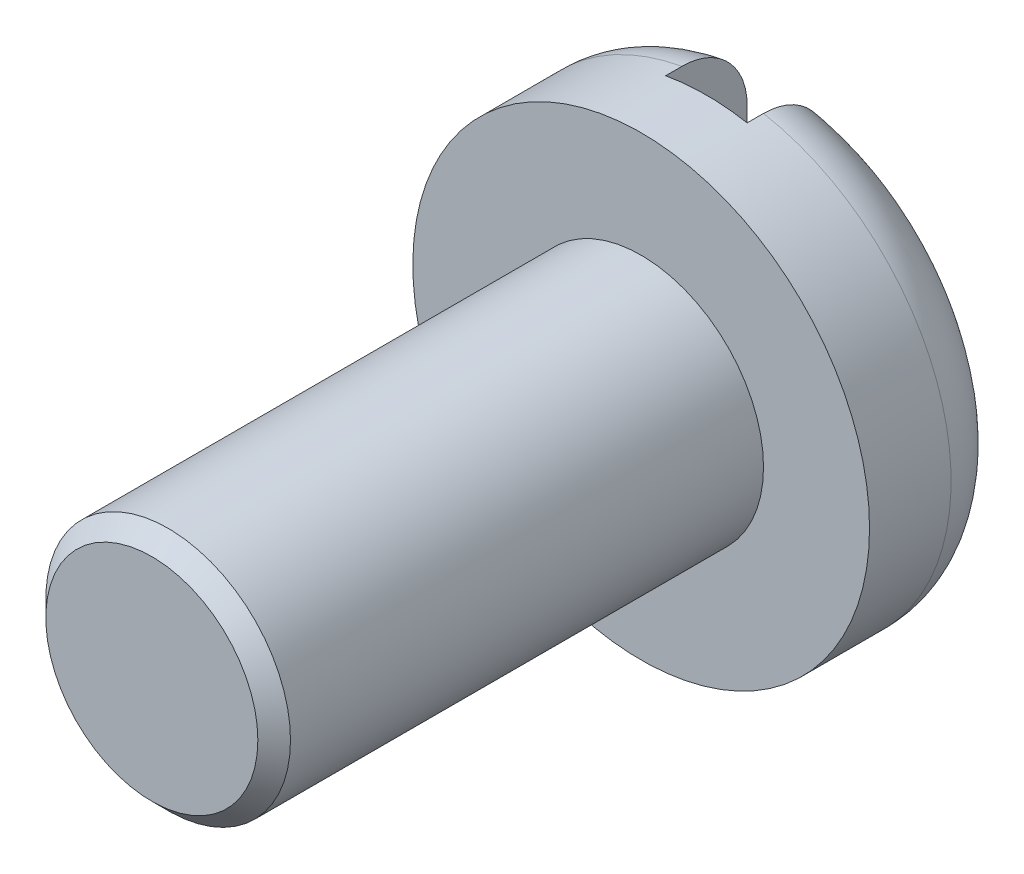
ISO-10303-21;
HEADER;
FILE_DESCRIPTION(('STEP AP214'),'2;1');
FILE_NAME('part.step','',(''),(''),'','','');
FILE_SCHEMA(('AUTOMOTIVE_DESIGN { 1 0 10303 214 1 1 1 1 }'));
ENDSEC;
DATA;
#1=APPLICATION_CONTEXT('core data for automotive mechanical design processes');
#2=APPLICATION_PROTOCOL_DEFINITION('international standard','automotive_design',2000,#1);
#3=PRODUCT_CONTEXT('',#1,'mechanical');
#4=PRODUCT('Part','Part','',(#3));
#5=PRODUCT_RELATED_PRODUCT_CATEGORY('part','',(#4));
#6=PRODUCT_DEFINITION_FORMATION('','',#4);
#7=PRODUCT_DEFINITION_CONTEXT('part definition',#1,'design');
#8=PRODUCT_DEFINITION('design','',#6,#7);
#9=PRODUCT_DEFINITION_SHAPE('','',#8);
#10=(LENGTH_UNIT() NAMED_UNIT(*) SI_UNIT(.MILLI.,.METRE.));
#11=(NAMED_UNIT(*) PLANE_ANGLE_UNIT() SI_UNIT($,.RADIAN.));
#12=(NAMED_UNIT(*) SI_UNIT($,.STERADIAN.) SOLID_ANGLE_UNIT());
#13=UNCERTAINTY_MEASURE_WITH_UNIT(LENGTH_MEASURE(1.E-05),#10,'distance_accuracy_value','');
#14=(GEOMETRIC_REPRESENTATION_CONTEXT(3) GLOBAL_UNCERTAINTY_ASSIGNED_CONTEXT((#13)) GLOBAL_UNIT_ASSIGNED_CONTEXT((#10,
#11,#12)) REPRESENTATION_CONTEXT('',''));
#15=CARTESIAN_POINT('',(0.,0.,0.));
#16=DIRECTION('',(0.,0.,1.));
#17=DIRECTION('',(1.,0.,0.));
#18=AXIS2_PLACEMENT_3D('',#15,#16,#17);
#19=CARTESIAN_POINT('',(0.,0.,0.));
#20=DIRECTION('',(0.,0.,1.));
#21=DIRECTION('',(1.,0.,0.));
#22=AXIS2_PLACEMENT_3D('',#19,#20,#21);
#23=PLANE('',#22);
#24=CARTESIAN_POINT('',(0.,0.,0.));
#25=DIRECTION('',(0.,0.,1.));
#26=DIRECTION('',(1.,0.,0.));
#27=AXIS2_PLACEMENT_3D('',#24,#25,#26);
#28=CIRCLE('',#27,2.);
#29=CARTESIAN_POINT('',(-0.5,-1.93649167310372,0.));
#30=VERTEX_POINT('',#29);
#31=CARTESIAN_POINT('',(-0.5,1.93649167310367,0.));
#32=VERTEX_POINT('',#31);
#33=EDGE_CURVE('E108',#30,#32,#28,.F.);
#34=ORIENTED_EDGE('',*,*,#33,.T.);
#35=DIRECTION('',(0.,1.,0.));
#36=VECTOR('',#35,1.);
#37=CARTESIAN_POINT('',(-0.499999999999987,-2.79999999999997,0.));
#38=LINE('',#37,#36);
#39=EDGE_CURVE('E96',#30,#32,#38,.T.);
#40=ORIENTED_EDGE('',*,*,#39,.F.);
#41=EDGE_LOOP('',(#34,#40));
#42=FACE_BOUND('',#41,.T.);
#43=ADVANCED_FACE('F34',(#42),#23,.F.);
#44=CARTESIAN_POINT('',(0.,0.,0.8));
#45=DIRECTION('',(0.,0.,1.));
#46=DIRECTION('',(1.,0.,0.));
#47=AXIS2_PLACEMENT_3D('',#44,#45,#46);
#48=TOROIDAL_SURFACE('',#47,2.,0.8);
#49=CARTESIAN_POINT('',(-0.500000000000042,-2.574922324518,0.298155199525206));
#50=CARTESIAN_POINT('',(-0.500000000000064,-2.54598098806483,0.262888244626921));
#51=CARTESIAN_POINT('',(-0.500000000000017,-2.51399085375587,0.230073383773666));
#52=CARTESIAN_POINT('',(-0.499999999999956,-2.44489770330804,0.170290375937446));
#53=CARTESIAN_POINT('',(-0.499999999999943,-2.40778734484533,0.14333077083532));
#54=CARTESIAN_POINT('',(-0.499999999999947,-2.3296378729819,0.0960285229568036));
#55=CARTESIAN_POINT('',(-0.499999999999966,-2.28860446041037,0.0756764619958677));
#56=CARTESIAN_POINT('',(-0.500000000000008,-2.20376135068432,0.0420244924251314));
#57=CARTESIAN_POINT('',(-0.500000000000031,-2.15995236699676,0.0287227796749258));
#58=CARTESIAN_POINT('',(-0.500000000000025,-2.06997091394333,0.00925183248130342));
#59=CARTESIAN_POINT('',(-0.499999999999993,-2.02377040690542,0.00321234810147741));
#60=CARTESIAN_POINT('',(-0.49999999999998,-1.93100263497437,-0.00124877563349874));
#61=CARTESIAN_POINT('',(-0.499999999999998,-1.88443530458141,0.000330977762108387));
#62=CARTESIAN_POINT('',(-0.500000000000003,-1.79088327346646,0.0111178799923772));
#63=CARTESIAN_POINT('',(-0.49999999999999,-1.7439228144173,0.0205353470541913));
#64=CARTESIAN_POINT('',(-0.499999999999983,-1.65217679369091,0.046935421935074));
#65=CARTESIAN_POINT('',(-0.499999999999988,-1.60739158710236,0.0639192603179388));
#66=CARTESIAN_POINT('',(-0.499999999999985,-1.52019073232421,0.105445949791884));
#67=CARTESIAN_POINT('',(-0.499999999999978,-1.47785400136175,0.130154782287374));
#68=CARTESIAN_POINT('',(-0.499999999999995,-1.39792453015221,0.18634538845088));
#69=CARTESIAN_POINT('',(-0.50000000000002,-1.36033263198163,0.217828361667366));
#70=CARTESIAN_POINT('',(-0.500000000000009,-1.29120447950117,0.286694192458513));
#71=CARTESIAN_POINT('',(-0.499999999999974,-1.25965123178523,0.324059937841605));
#72=CARTESIAN_POINT('',(-0.499999999999999,-1.20369168856285,0.403817480274002));
#73=CARTESIAN_POINT('',(-0.500000000000059,-1.17928268604714,0.44620736506247));
#74=CARTESIAN_POINT('',(-0.500000000000053,-1.13992248130589,0.532354713105318));
#75=CARTESIAN_POINT('',(-0.499999999999993,-1.12452210271751,0.575906194985524));
#76=CARTESIAN_POINT('',(-0.49999999999998,-1.10201829416784,0.66509381867765));
#77=CARTESIAN_POINT('',(-0.500000000000027,-1.09490840158941,0.710728307862662));
#78=CARTESIAN_POINT('',(-0.500000000000029,-1.08965339575104,0.798660775802905));
#79=CARTESIAN_POINT('',(-0.499999999999991,-1.09080730068015,0.840918076012923));
#80=CARTESIAN_POINT('',(-0.499999999999982,-1.10037450172082,0.924598224718412));
#81=CARTESIAN_POINT('',(-0.500000000000013,-1.10878745994187,0.966021111961848));
#82=CARTESIAN_POINT('',(-0.500000000000016,-1.13216837267961,1.04597158865165));
#83=CARTESIAN_POINT('',(-0.499999999999991,-1.14698904456269,1.08454267031556));
#84=CARTESIAN_POINT('',(-0.499999999999982,-1.18251177579709,1.15886756045566));
#85=CARTESIAN_POINT('',(-0.5,-1.20321527714693,1.19462067544403));
#86=CARTESIAN_POINT('',(-0.500000000000001,-1.25126751354911,1.26474992143909));
#87=CARTESIAN_POINT('',(-0.499999999999984,-1.27895554890733,1.29889325268955));
#88=CARTESIAN_POINT('',(-0.499999999999989,-1.3392878702617,1.36247528595323));
#89=CARTESIAN_POINT('',(-0.500000000000013,-1.37193384773364,1.39191237529941));
#90=CARTESIAN_POINT('',(-0.500000000000016,-1.44401810740901,1.44758530807222));
#91=CARTESIAN_POINT('',(-0.49999999999999,-1.48378730323865,1.47339358366004));
#92=CARTESIAN_POINT('',(-0.499999999999983,-1.56697728558621,1.51824355540426));
#93=CARTESIAN_POINT('',(-0.5,-1.61039886330884,1.53728378072535));
#94=CARTESIAN_POINT('',(-0.500000000000001,-1.70136104276629,1.56863849264839));
#95=CARTESIAN_POINT('',(-0.499999999999984,-1.74899346897788,1.58068768090996));
#96=CARTESIAN_POINT('',(-0.499999999999989,-1.84561382312309,1.59655662210236));
#97=CARTESIAN_POINT('',(-0.500000000000011,-1.89460174641329,1.60037640322053));
#98=CARTESIAN_POINT('',(-0.500000000000017,-1.9921524314953,1.59956806537918));
#99=CARTESIAN_POINT('',(-0.500000000000002,-2.04071566638595,1.59500198496043));
#100=CARTESIAN_POINT('',(-0.499999999999971,-2.13632725414342,1.57755309739998));
#101=CARTESIAN_POINT('',(-0.499999999999956,-2.18337580544831,1.56467138437918));
#102=CARTESIAN_POINT('',(-0.499999999999962,-2.27328529537051,1.53131446404627));
#103=CARTESIAN_POINT('',(-0.499999999999981,-2.3162240941652,1.51104918059278));
#104=CARTESIAN_POINT('',(-0.499999999999992,-2.39795495079203,1.46340202209778));
#105=CARTESIAN_POINT('',(-0.499999999999983,-2.43674763214091,1.43602121925978));
#106=CARTESIAN_POINT('',(-0.499999999999963,-2.50796623414367,1.37573601278644));
#107=CARTESIAN_POINT('',(-0.499999999999952,-2.54053689486565,1.34300254475207));
#108=CARTESIAN_POINT('',(-0.500000000000021,-2.59957752568887,1.2724306558834));
#109=CARTESIAN_POINT('',(-0.500000000000102,-2.62604823039698,1.23459285062639));
#110=CARTESIAN_POINT('',(-0.500000000000093,-2.67157353959601,1.15573976382321));
#111=CARTESIAN_POINT('',(-0.500000000000008,-2.69077061117966,1.11480669165031));
#112=CARTESIAN_POINT('',(-0.499999999999965,-2.72191897598462,1.03027270766606));
#113=CARTESIAN_POINT('',(-0.500000000000008,-2.73387115561365,0.986672122942012));
#114=CARTESIAN_POINT('',(-0.500000000000021,-2.75005556797333,0.898637160107996));
#115=CARTESIAN_POINT('',(-0.499999999999992,-2.75438419022644,0.854220475286738));
#116=CARTESIAN_POINT('',(-0.499999999999981,-2.75548594113135,0.765281171564029));
#117=CARTESIAN_POINT('',(-0.5,-2.75225733036693,0.720758530631277));
#118=CARTESIAN_POINT('',(-0.500000000000001,-2.73837145135229,0.633077517478008));
#119=CARTESIAN_POINT('',(-0.499999999999984,-2.72774415965583,0.589914372145898));
#120=CARTESIAN_POINT('',(-0.499999999999989,-2.69941974932609,0.506017569457456));
#121=CARTESIAN_POINT('',(-0.500000000000011,-2.68173177147183,0.465280848903881));
#122=CARTESIAN_POINT('',(-0.499999999999995,-2.6486018933594,0.403636926764014));
#123=CARTESIAN_POINT('',(-0.499999999999978,-2.63530419806188,0.381550226470756));
#124=CARTESIAN_POINT('',(-0.499999999999995,-2.60663582244822,0.338766791147228));
#125=CARTESIAN_POINT('',(-0.50000000000003,-2.59126516322905,0.318070041974346));
#126=CARTESIAN_POINT('',(-0.500000000000042,-2.574922324518,0.298155199525206));
#127=B_SPLINE_CURVE_WITH_KNOTS('',3,(#49,#50,#51,#52,#53,#54,#55,#56,#57,#58,#59,#60,#61,#62,
#63,#64,#65,#66,#67,#68,#69,#70,#71,#72,#73,#74,#75,#76,#77,#78,#79,#80,#81,#82,#83,#84,#85,#86,
#87,#88,#89,#90,#91,#92,#93,#94,#95,#96,#97,#98,#99,#100,#101,#102,#103,#104,#105,#106,#107,
#108,#109,#110,#111,#112,#113,#114,#115,#116,#117,#118,#119,#120,#121,#122,#123,#124,#125,#126),
.UNSPECIFIED.,.T.,.F.,(4,2,2,2,2,2,2,2,2,2,2,2,2,2,2,2,2,2,2,2,2,2,2,2,2,2,2,2,2,2,2,2,2,2,2,2,
2,2,4),(0.,0.136769193085177,0.273736589920394,0.410507891781044,0.547244177795591,
0.68638878734272,0.825558832649965,0.968588530443755,1.11164149850147,1.25800809201401,
1.40440062513062,1.5503749329885,1.69629385824464,1.83412607973232,1.97185078597633,
2.0980401485379,2.22422363762208,2.34764929877682,2.47110524015382,2.60242555016918,
2.73379076312852,2.87538180880564,3.01700360631827,3.16369746316592,3.3103908175575,
3.45600330421428,3.60159663596026,3.74333790058163,3.88505781926302,4.02291414270548,
4.16075385566943,4.29573382427652,4.43069727483905,4.56394170366886,4.69721680381809,
4.82995504436945,4.96252199615689,5.0397547671254,5.11698675213922),.UNSPECIFIED.);
#128=CARTESIAN_POINT('',(-0.499999999999917,-2.75499546279123,0.8));
#129=VERTEX_POINT('',#128);
#130=EDGE_CURVE('E152',#129,#30,#127,.T.);
#131=ORIENTED_EDGE('',*,*,#130,.F.);
#132=CARTESIAN_POINT('',(0.,0.,0.8));
#133=DIRECTION('',(0.,0.,1.));
#134=DIRECTION('',(1.,0.,0.));
#135=AXIS2_PLACEMENT_3D('',#132,#133,#134);
#136=CIRCLE('',#135,2.8);
#137=CARTESIAN_POINT('',(-0.500000000000028,2.7549954627912,0.8));
#138=VERTEX_POINT('',#137);
#139=EDGE_CURVE('E109',#138,#129,#136,.T.);
#140=ORIENTED_EDGE('',*,*,#139,.F.);
#141=CARTESIAN_POINT('',(-0.499999999356501,1.17166829458473,0.46418686904753));
#142=CARTESIAN_POINT('',(-0.499999999007219,1.19267357615146,0.422417780507498));
#143=CARTESIAN_POINT('',(-0.499999999733716,1.21743797333864,0.382484068214903));
#144=CARTESIAN_POINT('',(-0.500000000266866,1.27341877739793,0.30735400104595));
#145=CARTESIAN_POINT('',(-0.500000000071411,1.30464980628043,0.272168686107269));
#146=CARTESIAN_POINT('',(-0.499999999928815,1.37235748491803,0.207510707786025));
#147=CARTESIAN_POINT('',(-0.499999999980891,1.40881724534706,0.178020342456158));
#148=CARTESIAN_POINT('',(-0.500000000019074,1.48597833534383,0.125299278185819));
#149=CARTESIAN_POINT('',(-0.500000000005209,1.5266777935571,0.10206583361082));
#150=CARTESIAN_POINT('',(-0.499999999994576,1.61302287504707,0.0615752064472882));
#151=CARTESIAN_POINT('',(-0.49999999999854,1.65880348194959,0.0446051102007901));
#152=CARTESIAN_POINT('',(-0.500000000001434,1.75256520926182,0.0185470420039302));
#153=CARTESIAN_POINT('',(-0.500000000000363,1.80054669322732,0.00946037726494076));
#154=CARTESIAN_POINT('',(-0.499999999999581,1.89757398197848,-0.000503602469736283));
#155=CARTESIAN_POINT('',(-0.499999999999874,1.94662352533386,-0.00134482041100667));
#156=CARTESIAN_POINT('',(-0.500000000000099,2.04413927232538,0.00542159003976711));
#157=CARTESIAN_POINT('',(-0.50000000000003,2.09260554052552,0.0130282744560471));
#158=CARTESIAN_POINT('',(-0.499999999999972,2.18638284766427,0.0363136597219342));
#159=CARTESIAN_POINT('',(-0.499999999999981,2.23174072313643,0.0518035405617408));
#160=CARTESIAN_POINT('',(-0.499999999999993,2.31909462384134,0.090397317595015));
#161=CARTESIAN_POINT('',(-0.499999999999995,2.36109117492435,0.113500019923071));
#162=CARTESIAN_POINT('',(-0.500000000000005,2.43926883717495,0.165951907511055));
#163=CARTESIAN_POINT('',(-0.500000000000012,2.47558066725009,0.195106304948042));
#164=CARTESIAN_POINT('',(-0.499999999999961,2.54264688321358,0.259229250250845));
#165=CARTESIAN_POINT('',(-0.499999999999904,2.57340200694014,0.294197025011071));
#166=CARTESIAN_POINT('',(-0.499999999999903,2.62773971054273,0.368070214995808));
#167=CARTESIAN_POINT('',(-0.499999999999957,2.65147213285657,0.406865462624137));
#168=CARTESIAN_POINT('',(-0.500000000000016,2.69196936040413,0.487936656036954));
#169=CARTESIAN_POINT('',(-0.500000000000021,2.70873482403591,0.530212272463766));
#170=CARTESIAN_POINT('',(-0.500000000000007,2.73457417408301,0.616346516557325));
#171=CARTESIAN_POINT('',(-0.499999999999988,2.74376162387099,0.660171105210678));
#172=CARTESIAN_POINT('',(-0.499999999999985,2.75459021275317,0.748742353799453));
#173=CARTESIAN_POINT('',(-0.5,2.7562317357709,0.793488966707539));
#174=CARTESIAN_POINT('',(-0.500000000000001,2.75193406507526,0.882296051446308));
#175=CARTESIAN_POINT('',(-0.499999999999988,2.7460486796649,0.926359139654561));
#176=CARTESIAN_POINT('',(-0.499999999999985,2.72696875366774,1.01287203680982));
#177=CARTESIAN_POINT('',(-0.499999999999996,2.7137742978086,1.05532186445184));
#178=CARTESIAN_POINT('',(-0.500000000000004,2.68046062721738,1.13744918694941));
#179=CARTESIAN_POINT('',(-0.500000000000001,2.66033585198125,1.17712442478083));
#180=CARTESIAN_POINT('',(-0.499999999999972,2.61376491387087,1.25257058669212));
#181=CARTESIAN_POINT('',(-0.499999999999946,2.58731858541521,1.28834140846729));
#182=CARTESIAN_POINT('',(-0.499999999999944,2.5286285872319,1.35530700199108));
#183=CARTESIAN_POINT('',(-0.49999999999997,2.49633699794396,1.38645975622345));
#184=CARTESIAN_POINT('',(-0.500000000000003,2.42705565551312,1.44300481630574));
#185=CARTESIAN_POINT('',(-0.500000000000012,2.39006560545065,1.4683967578179));
#186=CARTESIAN_POINT('',(-0.499999999999989,2.31180075625716,1.51316085536133));
#187=CARTESIAN_POINT('',(-0.499999999999956,2.27046570719732,1.53242761609144));
#188=CARTESIAN_POINT('',(-0.500000000000017,2.18519964476282,1.5639258999662));
#189=CARTESIAN_POINT('',(-0.50000000000011,2.14126836546617,1.57615670106222));
#190=CARTESIAN_POINT('',(-0.500000000000113,2.0509556255416,1.59355624479341));
#191=CARTESIAN_POINT('',(-0.500000000000017,2.00454082128188,1.59855176700942));
#192=CARTESIAN_POINT('',(-0.499999999999956,1.91151980618021,1.60090411836747));
#193=CARTESIAN_POINT('',(-0.49999999999999,1.86491356935927,1.598259874062));
#194=CARTESIAN_POINT('',(-0.500000000000012,1.77145545960404,1.58532047051574));
#195=CARTESIAN_POINT('',(-0.499999999999998,1.72463270294184,1.57481489696403));
#196=CARTESIAN_POINT('',(-0.499999999999975,1.63334046852717,1.54626900741675));
#197=CARTESIAN_POINT('',(-0.499999999999965,1.58887138887822,1.52822742133131));
#198=CARTESIAN_POINT('',(-0.499999999999981,1.50252916218816,1.48463309532452));
#199=CARTESIAN_POINT('',(-0.500000000000006,1.46073564384593,1.45892237778647));
#200=CARTESIAN_POINT('',(-0.499999999999967,1.38206930059477,1.40081364332638));
#201=CARTESIAN_POINT('',(-0.499999999999901,1.34519732545493,1.36841447400829));
#202=CARTESIAN_POINT('',(-0.499999999999988,1.27778696417982,1.29792975959294));
#203=CARTESIAN_POINT('',(-0.500000000000139,1.24721327878641,1.25987808510847));
#204=CARTESIAN_POINT('',(-0.499999999999834,1.19335612750725,1.17891848718443));
#205=CARTESIAN_POINT('',(-0.499999999999378,1.17006907448704,1.13601296745241));
#206=CARTESIAN_POINT('',(-0.500000000000586,1.13308127721679,1.04923883676593));
#207=CARTESIAN_POINT('',(-0.500000000002125,1.11889370908597,1.00557843081165));
#208=CARTESIAN_POINT('',(-0.499999999997849,1.09880075562412,0.916385157633365));
#209=CARTESIAN_POINT('',(-0.499999999992037,1.09289167625854,0.870853134905996));
#210=CARTESIAN_POINT('',(-0.500000000007284,1.08985288930712,0.783258016819354));
#211=CARTESIAN_POINT('',(-0.500000000026179,1.09204273372152,0.741216766124547));
#212=CARTESIAN_POINT('',(-0.49999999997383,1.10358165617668,0.658171003192909));
#213=CARTESIAN_POINT('',(-0.49999999990271,1.11292095412185,0.617165153669265));
#214=CARTESIAN_POINT('',(-0.500000000047387,1.13173716442364,0.557832094241281));
#215=CARTESIAN_POINT('',(-0.500000000134682,1.13868424430638,0.538665049516267));
#216=CARTESIAN_POINT('',(-0.499999999865315,1.15407246676007,0.500944817183134));
#217=CARTESIAN_POINT('',(-0.499999999508732,1.16251334591183,0.482391522028879));
#218=CARTESIAN_POINT('',(-0.499999999356501,1.17166829458473,0.46418686904753));
#219=B_SPLINE_CURVE_WITH_KNOTS('',3,(#141,#142,#143,#144,#145,#146,#147,#148,#149,#150,#151,
#152,#153,#154,#155,#156,#157,#158,#159,#160,#161,#162,#163,#164,#165,#166,#167,#168,#169,#170,
#171,#172,#173,#174,#175,#176,#177,#178,#179,#180,#181,#182,#183,#184,#185,#186,#187,#188,#189,
#190,#191,#192,#193,#194,#195,#196,#197,#198,#199,#200,#201,#202,#203,#204,#205,#206,#207,#208,
#209,#210,#211,#212,#213,#214,#215,#216,#217,#218),.UNSPECIFIED.,.T.,.F.,(4,2,2,2,2,2,2,2,2,2,2,
2,2,2,2,2,2,2,2,2,2,2,2,2,2,2,2,2,2,2,2,2,2,2,2,2,2,2,4),(0.,0.140179962938361,
0.280680424374975,0.420736870704918,0.560731757564349,0.706519737259577,0.852331886544,
0.998782091076204,1.14521593278487,1.28829675581313,1.43135515114943,1.57037428224833,
1.70937494032989,1.84515095108353,1.98091412768567,2.11460378002058,2.24828663038504,
2.38101913030596,2.5137500916072,2.64658779796054,2.77942898413334,2.91341306192966,
3.04740561107584,3.18359253664264,3.31979343557669,3.45920410723755,3.59863436815094,
3.74193637650256,3.88526254616111,4.03177315461668,4.17830902741986,4.32399983406551,
4.46961880536737,4.60659735480203,4.74351476205878,4.86920017065931,4.99471395445012,
5.05582079954678,5.11691687967277),.UNSPECIFIED.);
#220=EDGE_CURVE('E105',#32,#138,#219,.T.);
#221=ORIENTED_EDGE('',*,*,#220,.F.);
#222=ORIENTED_EDGE('',*,*,#33,.F.);
#223=EDGE_LOOP('',(#131,#140,#221,#222));
#224=FACE_BOUND('',#223,.T.);
#225=ADVANCED_FACE('F169',(#224),#48,.T.);
#226=CARTESIAN_POINT('',(0.,0.,1.8));
#227=DIRECTION('',(0.,0.,1.));
#228=DIRECTION('',(1.,0.,0.));
#229=AXIS2_PLACEMENT_3D('',#226,#227,#228);
#230=PLANE('',#229);
#231=CARTESIAN_POINT('',(0.,0.,1.8));
#232=DIRECTION('',(0.,0.,1.));
#233=DIRECTION('',(1.,0.,0.));
#234=AXIS2_PLACEMENT_3D('',#231,#232,#233);
#235=CIRCLE('',#234,2.8);
#236=CARTESIAN_POINT('',(2.8,0.,1.8));
#237=VERTEX_POINT('',#236);
#238=EDGE_CURVE('E181',#237,#237,#235,.T.);
#239=ORIENTED_EDGE('',*,*,#238,.T.);
#240=EDGE_LOOP('',(#239));
#241=FACE_BOUND('',#240,.T.);
#242=CARTESIAN_POINT('',(0.,0.,1.8));
#243=DIRECTION('',(0.,0.,1.));
#244=DIRECTION('',(1.,0.,0.));
#245=AXIS2_PLACEMENT_3D('',#242,#243,#244);
#246=CIRCLE('',#245,1.5);
#247=CARTESIAN_POINT('',(1.5,0.,1.8));
#248=VERTEX_POINT('',#247);
#249=EDGE_CURVE('E179',#248,#248,#246,.T.);
#250=ORIENTED_EDGE('',*,*,#249,.F.);
#251=EDGE_LOOP('',(#250));
#252=FACE_BOUND('',#251,.T.);
#253=ADVANCED_FACE('F186',(#241,#252),#230,.T.);
#254=CARTESIAN_POINT('',(0.,0.,1.8));
#255=DIRECTION('',(0.,0.,-1.));
#256=DIRECTION('',(-1.,0.,0.));
#257=AXIS2_PLACEMENT_3D('',#254,#255,#256);
#258=CYLINDRICAL_SURFACE('',#257,2.8);
#259=CARTESIAN_POINT('',(0.499999999999987,-2.75499546279118,0.8));
#260=VERTEX_POINT('',#259);
#261=CARTESIAN_POINT('',(0.5,2.75499546279118,0.8));
#262=VERTEX_POINT('',#261);
#263=EDGE_CURVE('E104',#260,#262,#136,.T.);
#264=ORIENTED_EDGE('',*,*,#263,.T.);
#265=DIRECTION('',(0.,0.,-1.));
#266=VECTOR('',#265,1.);
#267=CARTESIAN_POINT('',(0.5,2.75499546279118,1.8));
#268=LINE('',#267,#266);
#269=CARTESIAN_POINT('',(0.5,2.75499546279118,1.));
#270=VERTEX_POINT('',#269);
#271=EDGE_CURVE('E49',#262,#270,#268,.F.);
#272=ORIENTED_EDGE('',*,*,#271,.T.);
#273=CARTESIAN_POINT('',(0.,0.,1.));
#274=DIRECTION('',(0.,0.,1.));
#275=DIRECTION('',(1.,0.,0.));
#276=AXIS2_PLACEMENT_3D('',#273,#274,#275);
#277=CIRCLE('',#276,2.8);
#278=CARTESIAN_POINT('',(-0.500000000000028,2.7549954627912,1.));
#279=VERTEX_POINT('',#278);
#280=EDGE_CURVE('E38',#270,#279,#277,.T.);
#281=ORIENTED_EDGE('',*,*,#280,.T.);
#282=DIRECTION('',(0.,0.,-1.));
#283=VECTOR('',#282,1.);
#284=CARTESIAN_POINT('',(-0.500000000000028,2.7549954627912,1.8));
#285=LINE('',#284,#283);
#286=EDGE_CURVE('E160',#279,#138,#285,.T.);
#287=ORIENTED_EDGE('',*,*,#286,.T.);
#288=ORIENTED_EDGE('',*,*,#139,.T.);
#289=DIRECTION('',(0.,0.,-1.));
#290=VECTOR('',#289,1.);
#291=CARTESIAN_POINT('',(-0.499999999999917,-2.75499546279123,1.8));
#292=LINE('',#291,#290);
#293=CARTESIAN_POINT('',(-0.499999999999917,-2.75499546279123,1.));
#294=VERTEX_POINT('',#293);
#295=EDGE_CURVE('E57',#129,#294,#292,.F.);
#296=ORIENTED_EDGE('',*,*,#295,.T.);
#297=CARTESIAN_POINT('',(0.499999999999987,-2.75499546279118,1.));
#298=VERTEX_POINT('',#297);
#299=EDGE_CURVE('E11',#294,#298,#277,.T.);
#300=ORIENTED_EDGE('',*,*,#299,.T.);
#301=DIRECTION('',(0.,0.,-1.));
#302=VECTOR('',#301,1.);
#303=CARTESIAN_POINT('',(0.499999999999987,-2.75499546279118,1.8));
#304=LINE('',#303,#302);
#305=EDGE_CURVE('E167',#298,#260,#304,.T.);
#306=ORIENTED_EDGE('',*,*,#305,.T.);
#307=EDGE_LOOP('',(#264,#272,#281,#287,#288,#296,#300,#306));
#308=FACE_BOUND('',#307,.T.);
#309=ORIENTED_EDGE('',*,*,#238,.F.);
#310=EDGE_LOOP('',(#309));
#311=FACE_BOUND('',#310,.T.);
#312=ADVANCED_FACE('F36',(#308,#311),#258,.T.);
#313=CARTESIAN_POINT('',(0.5,1.93649167311966,0.));
#314=VERTEX_POINT('',#313);
#315=CARTESIAN_POINT('',(0.5,-1.93649167310367,0.));
#316=VERTEX_POINT('',#315);
#317=EDGE_CURVE('E102',#314,#316,#28,.F.);
#318=ORIENTED_EDGE('',*,*,#317,.T.);
#319=DIRECTION('',(0.,1.,0.));
#320=VECTOR('',#319,1.);
#321=CARTESIAN_POINT('',(0.499999999999945,-2.79999999999997,0.));
#322=LINE('',#321,#320);
#323=EDGE_CURVE('E87',#316,#314,#322,.T.);
#324=ORIENTED_EDGE('',*,*,#323,.T.);
#325=EDGE_LOOP('',(#318,#324));
#326=FACE_BOUND('',#325,.T.);
#327=ADVANCED_FACE('F107',(#326),#23,.F.);
#328=CARTESIAN_POINT('',(0.500000000879811,-2.5749223251037,0.298155199044635));
#329=CARTESIAN_POINT('',(0.500000001072099,-2.60316672277935,0.332579391269987));
#330=CARTESIAN_POINT('',(0.500000000287356,-2.62854948203002,0.369390453220737));
#331=CARTESIAN_POINT('',(0.49999999971223,-2.67280796870897,0.446774396094247));
#332=CARTESIAN_POINT('',(0.499999999922898,-2.6916767992218,0.487351206867537));
#333=CARTESIAN_POINT('',(0.50000000007707,-2.7223109911068,0.571105483193361));
#334=CARTESIAN_POINT('',(0.500000000020594,-2.73407684575013,0.614282767925082));
#335=CARTESIAN_POINT('',(0.499999999979301,-2.75014124796438,0.701994783671056));
#336=CARTESIAN_POINT('',(0.499999999994469,-2.75444151138484,0.746529200374766));
#337=CARTESIAN_POINT('',(0.500000000005473,-2.75544604981184,0.83542907904915));
#338=CARTESIAN_POINT('',(0.500000000001418,-2.75219346258918,0.879794058020162));
#339=CARTESIAN_POINT('',(0.499999999998472,-2.73828036853049,0.967346901444565));
#340=CARTESIAN_POINT('',(0.49999999999958,-2.72761975658292,1.01053474918676));
#341=CARTESIAN_POINT('',(0.500000000000365,-2.69922170832223,1.09448759036863));
#342=CARTESIAN_POINT('',(0.500000000000043,-2.68148840045398,1.13525398132962));
#343=CARTESIAN_POINT('',(0.499999999999847,-2.63947637337052,1.21325938895333));
#344=CARTESIAN_POINT('',(0.499999999999973,-2.61519753470354,1.25049834122576));
#345=CARTESIAN_POINT('',(0.500000000000029,-2.56061340850498,1.32069364818094));
#346=CARTESIAN_POINT('',(0.499999999999957,-2.53026581413391,1.35361708906897));
#347=CARTESIAN_POINT('',(0.499999999999933,-2.46454688604084,1.41399178546976));
#348=CARTESIAN_POINT('',(0.499999999999979,-2.42917527522167,1.44144273894931));
#349=CARTESIAN_POINT('',(0.499999999999994,-2.35385643502779,1.49055090188861));
#350=CARTESIAN_POINT('',(0.499999999999961,-2.31384845997951,1.51211489687122));
#351=CARTESIAN_POINT('',(0.499999999999929,-2.23083915065947,1.5483853151228));
#352=CARTESIAN_POINT('',(0.499999999999931,-2.18783752986508,1.56309108094895));
#353=CARTESIAN_POINT('',(0.499999999999931,-2.09903776473294,1.58559376537929));
#354=CARTESIAN_POINT('',(0.49999999999993,-2.05319854673997,1.59322847724039));
#355=CARTESIAN_POINT('',(0.49999999999996,-1.96089071229865,1.60091468708442));
#356=CARTESIAN_POINT('',(0.499999999999991,-1.91442201135201,1.60096515670798));
#357=CARTESIAN_POINT('',(0.499999999999982,-1.82081512442864,1.5934796467817));
#358=CARTESIAN_POINT('',(0.49999999999994,-1.77369359984158,1.58573528250449));
#359=CARTESIAN_POINT('',(0.49999999999995,-1.68135124221952,1.56264149053293));
#360=CARTESIAN_POINT('',(0.500000000000002,-1.63613071586754,1.54729084080561));
#361=CARTESIAN_POINT('',(0.499999999999999,-1.54772088198927,1.5089710882286));
#362=CARTESIAN_POINT('',(0.499999999999941,-1.50460810218891,1.48582516379542));
#363=CARTESIAN_POINT('',(0.499999999999949,-1.42285362314232,1.43263708398556));
#364=CARTESIAN_POINT('',(0.500000000000017,-1.3842127749951,1.40259361910328));
#365=CARTESIAN_POINT('',(0.500000000000012,-1.31255959666647,1.33630715335168));
#366=CARTESIAN_POINT('',(0.499999999999941,-1.27955494140269,1.3000558314644));
#367=CARTESIAN_POINT('',(0.499999999999949,-1.22046453800474,1.22228169989798));
#368=CARTESIAN_POINT('',(0.50000000000003,-1.19437681399472,1.18076040065168));
#369=CARTESIAN_POINT('',(0.500000000000027,-1.15142216098089,1.09574586213182));
#370=CARTESIAN_POINT('',(0.499999999999951,-1.13416335222775,1.05245139645305));
#371=CARTESIAN_POINT('',(0.499999999999939,-1.10793289425679,0.963428982378384));
#372=CARTESIAN_POINT('',(0.500000000000003,-1.09895451442801,0.917703042402015));
#373=CARTESIAN_POINT('',(0.499999999999998,-1.09022472356232,0.829298122134937));
#374=CARTESIAN_POINT('',(0.499999999999941,-1.08975649686917,0.786688925401454));
#375=CARTESIAN_POINT('',(0.499999999999949,-1.09624620786004,0.702044692272699));
#376=CARTESIAN_POINT('',(0.500000000000015,-1.10320328532025,0.660009589939735));
#377=CARTESIAN_POINT('',(0.500000000000013,-1.12382367656128,0.579065755118516));
#378=CARTESIAN_POINT('',(0.49999999999995,-1.13726593553652,0.540100063897481));
#379=CARTESIAN_POINT('',(0.49999999999994,-1.17014975791577,0.464794622695565));
#380=CARTESIAN_POINT('',(0.499999999999994,-1.18959269992823,0.428455478512849));
#381=CARTESIAN_POINT('',(0.500000000000007,-1.23503762747252,0.357176464248562));
#382=CARTESIAN_POINT('',(0.49999999999996,-1.26135130749175,0.322435696992511));
#383=CARTESIAN_POINT('',(0.49999999999993,-1.31903408169354,0.257443494849274));
#384=CARTESIAN_POINT('',(0.499999999999946,-1.35040489701462,0.227193595134763));
#385=CARTESIAN_POINT('',(0.499999999999943,-1.42003468298558,0.169555271876546));
#386=CARTESIAN_POINT('',(0.499999999999921,-1.45864388595744,0.142589172665923));
#387=CARTESIAN_POINT('',(0.499999999999969,-1.53969772981556,0.0952129953060812));
#388=CARTESIAN_POINT('',(0.50000000000004,-1.58214329645024,0.0748045050067149));
#389=CARTESIAN_POINT('',(0.499999999999959,-1.67157713375841,0.040373490367606));
#390=CARTESIAN_POINT('',(0.499999999999799,-1.71868053469734,0.0266488619012781));
#391=CARTESIAN_POINT('',(0.500000000000091,-1.81452842648651,0.00733250693377024));
#392=CARTESIAN_POINT('',(0.500000000000542,-1.86327288106042,0.00174060077521762));
#393=CARTESIAN_POINT('',(0.499999999999378,-1.96081528894648,-0.00104060646324223));
#394=CARTESIAN_POINT('',(0.49999999999777,-2.00961228142522,0.00173720006392133));
#395=CARTESIAN_POINT('',(0.50000000000212,-2.10601253288823,0.0156698370040204));
#396=CARTESIAN_POINT('',(0.500000000008079,-2.15361562973939,0.026825798887446));
#397=CARTESIAN_POINT('',(0.499999999992096,-2.24497498800377,0.0569114625320277));
#398=CARTESIAN_POINT('',(0.499999999970849,-2.28879770253638,0.0756396540687247));
#399=CARTESIAN_POINT('',(0.500000000029,-2.37250420976848,0.1203815830717));
#400=CARTESIAN_POINT('',(0.500000000108257,-2.41239348348014,0.146384983262922));
#401=CARTESIAN_POINT('',(0.499999999933198,-2.47270069368019,0.193717404759919));
#402=CARTESIAN_POINT('',(0.499999999794882,-2.49473023944843,0.213029740806942));
#403=CARTESIAN_POINT('',(0.500000000205004,-2.53655931776771,0.253936127323133));
#404=CARTESIAN_POINT('',(0.500000000753431,-2.55635889021424,0.275530136958482));
#405=CARTESIAN_POINT('',(0.500000000879811,-2.5749223251037,0.298155199044635));
#406=B_SPLINE_CURVE_WITH_KNOTS('',3,(#328,#329,#330,#331,#332,#333,#334,#335,#336,#337,#338,
#339,#340,#341,#342,#343,#344,#345,#346,#347,#348,#349,#350,#351,#352,#353,#354,#355,#356,#357,
#358,#359,#360,#361,#362,#363,#364,#365,#366,#367,#368,#369,#370,#371,#372,#373,#374,#375,#376,
#377,#378,#379,#380,#381,#382,#383,#384,#385,#386,#387,#388,#389,#390,#391,#392,#393,#394,#395,
#396,#397,#398,#399,#400,#401,#402,#403,#404,#405),.UNSPECIFIED.,.T.,.F.,(4,2,2,2,2,2,2,2,2,2,2,
2,2,2,2,2,2,2,2,2,2,2,2,2,2,2,2,2,2,2,2,2,2,2,2,2,2,2,4),(0.,0.13347948049619,0.267099858043289,
0.400710955161736,0.534291339789101,0.66711066398364,0.799931872773255,0.932675664918383,
1.06542187971723,1.19912796050581,1.33284141865341,1.46856324275726,1.60429807473887,
1.74307461888265,1.88186997993984,2.02447707815703,2.16710709519683,2.3132187482915,
2.4593581638157,2.60569502038304,2.75199002952824,2.89105727432612,3.03001138070959,
3.15720142762108,3.28437674112491,3.40749433905576,3.53064024334199,3.66083382660082,
3.79107181367926,3.93172557360624,4.07241336560898,4.2189001432263,4.36538368480181,
4.51129230800911,4.65722063973086,4.7994973609199,4.94157294028144,5.02930297479893,
5.11703143952757),.UNSPECIFIED.);
#407=EDGE_CURVE('E90',#316,#260,#406,.T.);
#408=ORIENTED_EDGE('',*,*,#407,.F.);
#409=ORIENTED_EDGE('',*,*,#317,.F.);
#410=CARTESIAN_POINT('',(0.500000000000014,1.17166829498083,0.464186869246702));
#411=CARTESIAN_POINT('',(0.500000000000019,1.15286490719749,0.501584191541624));
#412=CARTESIAN_POINT('',(0.499999999999944,1.1370473935071,0.540502060888832));
#413=CARTESIAN_POINT('',(0.499999999999947,1.11208351406139,0.620439318934003));
#414=CARTESIAN_POINT('',(0.500000000000025,1.10293831736921,0.661459074558685));
#415=CARTESIAN_POINT('',(0.500000000000032,1.0917839378532,0.744535161547929));
#416=CARTESIAN_POINT('',(0.49999999999996,1.08978638447821,0.786593070199633));
#417=CARTESIAN_POINT('',(0.49999999999993,1.09307364472781,0.870417588011927));
#418=CARTESIAN_POINT('',(0.499999999999971,1.09835784698396,0.912184221331787));
#419=CARTESIAN_POINT('',(0.499999999999975,1.11572332154511,0.993310454340729));
#420=CARTESIAN_POINT('',(0.499999999999939,1.12765363199267,1.03270270101104));
#421=CARTESIAN_POINT('',(0.499999999999951,1.15765003423169,1.10907179049493));
#422=CARTESIAN_POINT('',(0.499999999999999,1.1757176841687,1.14604801708493));
#423=CARTESIAN_POINT('',(0.500000000000002,1.21832528559521,1.21853019136645));
#424=CARTESIAN_POINT('',(0.499999999999953,1.24314000558142,1.25387422278319));
#425=CARTESIAN_POINT('',(0.499999999999937,1.2979289145463,1.32030288074351));
#426=CARTESIAN_POINT('',(0.499999999999969,1.32790478344615,1.35138611448902));
#427=CARTESIAN_POINT('',(0.499999999999976,1.39480977643481,1.41103152886074));
#428=CARTESIAN_POINT('',(0.499999999999946,1.43210639080297,1.43918212139929));
#429=CARTESIAN_POINT('',(0.499999999999944,1.51072119622881,1.48916257776538));
#430=CARTESIAN_POINT('',(0.499999999999974,1.55204044945362,1.51099076609775));
#431=CARTESIAN_POINT('',(0.499999999999972,1.63965054280649,1.54865348724877));
#432=CARTESIAN_POINT('',(0.499999999999938,1.68608379380109,1.56415794792977));
#433=CARTESIAN_POINT('',(0.499999999999953,1.78089689477321,1.58715917306053));
#434=CARTESIAN_POINT('',(0.500000000000002,1.82927682347556,1.5946556133226));
#435=CARTESIAN_POINT('',(0.499999999999999,1.92663314543548,1.60133167735585));
#436=CARTESIAN_POINT('',(0.499999999999947,1.97560976689266,1.60050801265907));
#437=CARTESIAN_POINT('',(0.499999999999943,2.07269237246762,1.59043702295005));
#438=CARTESIAN_POINT('',(0.499999999999992,2.12079845402432,1.58119064670823));
#439=CARTESIAN_POINT('',(0.499999999999981,2.21351928838756,1.55475710949363));
#440=CARTESIAN_POINT('',(0.499999999999924,2.25819038733622,1.53776773873429));
#441=CARTESIAN_POINT('',(0.499999999999966,2.3439226118335,1.49631790865984));
#442=CARTESIAN_POINT('',(0.500000000000065,2.38498429287177,1.47185860157004));
#443=CARTESIAN_POINT('',(0.500000000000074,2.46110962498127,1.4169118938635));
#444=CARTESIAN_POINT('',(0.49999999999999,2.49630913454152,1.38661266808464));
#445=CARTESIAN_POINT('',(0.4999999999999,2.56097498818907,1.32041261157628));
#446=CARTESIAN_POINT('',(0.499999999999894,2.59044208447851,1.2845125169033));
#447=CARTESIAN_POINT('',(0.499999999999912,2.64212035398314,1.20900822189132));
#448=CARTESIAN_POINT('',(0.499999999999935,2.66447970770443,1.16950539482413));
#449=CARTESIAN_POINT('',(0.499999999999955,2.70213653879064,1.08726601386267));
#450=CARTESIAN_POINT('',(0.499999999999952,2.71743464721824,1.0445297493378));
#451=CARTESIAN_POINT('',(0.499999999999938,2.74032399842679,0.957703660346023));
#452=CARTESIAN_POINT('',(0.499999999999928,2.74802348415175,0.913642344282669));
#453=CARTESIAN_POINT('',(0.499999999999962,2.75586392332593,0.824852881675614));
#454=CARTESIAN_POINT('',(0.500000000000005,2.75600523354932,0.780124766707013));
#455=CARTESIAN_POINT('',(0.499999999999996,2.74874876156885,0.691570520094466));
#456=CARTESIAN_POINT('',(0.499999999999944,2.74139859513446,0.647740475610244));
#457=CARTESIAN_POINT('',(0.499999999999946,2.7194547553424,0.561934169189615));
#458=CARTESIAN_POINT('',(0.500000000000001,2.70486113563565,0.519957893525192));
#459=CARTESIAN_POINT('',(0.5,2.66884083825132,0.438969901910687));
#460=CARTESIAN_POINT('',(0.499999999999945,2.64740342565631,0.399962963400045));
#461=CARTESIAN_POINT('',(0.499999999999945,2.59834153851638,0.32605888344201));
#462=CARTESIAN_POINT('',(0.5,2.57071688439261,0.291161861325933));
#463=CARTESIAN_POINT('',(0.5,2.50980390124887,0.226103419096332));
#464=CARTESIAN_POINT('',(0.499999999999944,2.47646490932941,0.195989455978503));
#465=CARTESIAN_POINT('',(0.499999999999946,2.40527784194692,0.14167564483067));
#466=CARTESIAN_POINT('',(0.500000000000004,2.36742945950473,0.117476199777209));
#467=CARTESIAN_POINT('',(0.500000000000025,2.28761534314965,0.0752183940227361));
#468=CARTESIAN_POINT('',(0.499999999999986,2.24559018560578,0.0572723299016524));
#469=CARTESIAN_POINT('',(0.499999999999904,2.15917067825682,0.0285058009642844));
#470=CARTESIAN_POINT('',(0.499999999999861,2.11477606864767,0.0176861192790055));
#471=CARTESIAN_POINT('',(0.499999999999862,2.02373470750858,0.00318864749584922));
#472=CARTESIAN_POINT('',(0.499999999999907,1.97705945352866,-0.000309981669377114));
#473=CARTESIAN_POINT('',(0.499999999999983,1.883766762488,0.000353273239346742));
#474=CARTESIAN_POINT('',(0.500000000000012,1.837149331945,0.00451595403566432));
#475=CARTESIAN_POINT('',(0.499999999999988,1.74391955615876,0.020518090407101));
#476=CARTESIAN_POINT('',(0.499999999999931,1.69734316616493,0.0325671289651834));
#477=CARTESIAN_POINT('',(0.499999999999959,1.60678555703931,0.0641535248578138));
#478=CARTESIAN_POINT('',(0.500000000000043,1.56280540920877,0.0836939488204968));
#479=CARTESIAN_POINT('',(0.500000000000041,1.47775501525637,0.130213658141233));
#480=CARTESIAN_POINT('',(0.499999999999953,1.43676597448897,0.157341517390449));
#481=CARTESIAN_POINT('',(0.499999999999937,1.36000018900964,0.218139350051696));
#482=CARTESIAN_POINT('',(0.500000000000011,1.32421836350455,0.251802870576174));
#483=CARTESIAN_POINT('',(0.499999999999993,1.2679484544189,0.314864191349277));
#484=CARTESIAN_POINT('',(0.49999999999994,1.2459491289144,0.342927090550124));
#485=CARTESIAN_POINT('',(0.499999999999949,1.20580349187635,0.401689472805686));
#486=CARTESIAN_POINT('',(0.500000000000011,1.18765652422409,0.432388505631356));
#487=CARTESIAN_POINT('',(0.500000000000014,1.17166829498083,0.464186869246702));
#488=B_SPLINE_CURVE_WITH_KNOTS('',3,(#410,#411,#412,#413,#414,#415,#416,#417,#418,#419,#420,
#421,#422,#423,#424,#425,#426,#427,#428,#429,#430,#431,#432,#433,#434,#435,#436,#437,#438,#439,
#440,#441,#442,#443,#444,#445,#446,#447,#448,#449,#450,#451,#452,#453,#454,#455,#456,#457,#458,
#459,#460,#461,#462,#463,#464,#465,#466,#467,#468,#469,#470,#471,#472,#473,#474,#475,#476,#477,
#478,#479,#480,#481,#482,#483,#484,#485,#486,#487),.UNSPECIFIED.,.T.,.F.,(4,2,2,2,2,2,2,2,2,2,2,
2,2,2,2,2,2,2,2,2,2,2,2,2,2,2,2,2,2,2,2,2,2,2,2,2,2,2,4),(0.,0.125457911546338,
0.250937799419964,0.376621754566587,0.502295158065316,0.625223973183382,0.748184020779342,
0.877195445580167,1.00624894244056,1.14581450939659,1.28541702873948,1.43158350138138,
1.57775589103808,1.72398605665153,1.87019975230755,2.01287144799899,2.1555211479231,
2.29417256634898,2.43280577876991,2.56832348506113,2.70382907780466,2.83737525272478,
2.97091512375986,3.10361147726301,3.23630684792346,3.36921139077848,3.50211979156258,
3.63627405093113,3.77043744814623,3.90689904115822,4.04337562767964,4.18315478233662,
4.3229484738642,4.46661689700617,4.61034419428778,4.75711095099982,4.90373352998626,
5.01042663416338,5.11710155217788),.UNSPECIFIED.);
#489=EDGE_CURVE('E92',#262,#314,#488,.T.);
#490=ORIENTED_EDGE('',*,*,#489,.F.);
#491=ORIENTED_EDGE('',*,*,#263,.F.);
#492=EDGE_LOOP('',(#408,#409,#490,#491));
#493=FACE_BOUND('',#492,.T.);
#494=ADVANCED_FACE('F101',(#493),#48,.T.);
#495=CARTESIAN_POINT('',(0.,0.,7.8));
#496=DIRECTION('',(0.,0.,-1.));
#497=DIRECTION('',(-1.,0.,0.));
#498=AXIS2_PLACEMENT_3D('',#495,#496,#497);
#499=CYLINDRICAL_SURFACE('',#498,1.5);
#500=CARTESIAN_POINT('',(0.,0.,7.6));
#501=DIRECTION('',(0.,0.,1.));
#502=DIRECTION('',(1.,0.,0.));
#503=AXIS2_PLACEMENT_3D('',#500,#501,#502);
#504=CIRCLE('',#503,1.5);
#505=CARTESIAN_POINT('',(1.5,0.,7.6));
#506=VERTEX_POINT('',#505);
#507=EDGE_CURVE('E119',#506,#506,#504,.F.);
#508=ORIENTED_EDGE('',*,*,#507,.T.);
#509=EDGE_LOOP('',(#508));
#510=FACE_BOUND('',#509,.T.);
#511=ORIENTED_EDGE('',*,*,#249,.T.);
#512=EDGE_LOOP('',(#511));
#513=FACE_BOUND('',#512,.T.);
#514=ADVANCED_FACE('F200',(#510,#513),#499,.T.);
#515=CARTESIAN_POINT('',(0.,0.,7.8));
#516=DIRECTION('',(0.,0.,1.));
#517=DIRECTION('',(1.,0.,0.));
#518=AXIS2_PLACEMENT_3D('',#515,#516,#517);
#519=PLANE('',#518);
#520=CARTESIAN_POINT('',(0.,0.,7.8));
#521=DIRECTION('',(0.,0.,1.));
#522=DIRECTION('',(1.,0.,0.));
#523=AXIS2_PLACEMENT_3D('',#520,#521,#522);
#524=CIRCLE('',#523,1.3);
#525=CARTESIAN_POINT('',(1.3,0.,7.8));
#526=VERTEX_POINT('',#525);
#527=EDGE_CURVE('E112',#526,#526,#524,.T.);
#528=ORIENTED_EDGE('',*,*,#527,.T.);
#529=EDGE_LOOP('',(#528));
#530=FACE_BOUND('',#529,.T.);
#531=ADVANCED_FACE('F204',(#530),#519,.T.);
#532=CARTESIAN_POINT('',(0.,0.,7.8));
#533=DIRECTION('',(0.,0.,-1.));
#534=DIRECTION('',(-1.,0.,0.));
#535=AXIS2_PLACEMENT_3D('',#532,#533,#534);
#536=CONICAL_SURFACE('',#535,1.3,0.785398163397454);
#537=ORIENTED_EDGE('',*,*,#507,.F.);
#538=EDGE_LOOP('',(#537));
#539=FACE_BOUND('',#538,.T.);
#540=ORIENTED_EDGE('',*,*,#527,.F.);
#541=EDGE_LOOP('',(#540));
#542=FACE_BOUND('',#541,.T.);
#543=ADVANCED_FACE('F142',(#539,#542),#536,.T.);
#544=CARTESIAN_POINT('',(-0.499999999999987,-2.79999999999997,1.));
#545=DIRECTION('',(0.,0.,1.));
#546=DIRECTION('',(1.,0.,0.));
#547=AXIS2_PLACEMENT_3D('',#544,#545,#546);
#548=PLANE('',#547);
#549=DIRECTION('',(0.,1.,0.));
#550=VECTOR('',#549,1.);
#551=CARTESIAN_POINT('',(0.499999999999945,-2.79999999999997,1.));
#552=LINE('',#551,#550);
#553=EDGE_CURVE('E97',#298,#270,#552,.T.);
#554=ORIENTED_EDGE('',*,*,#553,.F.);
#555=ORIENTED_EDGE('',*,*,#299,.F.);
#556=DIRECTION('',(0.,1.,0.));
#557=VECTOR('',#556,1.);
#558=CARTESIAN_POINT('',(-0.499999999999987,-2.79999999999997,1.));
#559=LINE('',#558,#557);
#560=EDGE_CURVE('E175',#294,#279,#559,.T.);
#561=ORIENTED_EDGE('',*,*,#560,.T.);
#562=ORIENTED_EDGE('',*,*,#280,.F.);
#563=EDGE_LOOP('',(#554,#555,#561,#562));
#564=FACE_BOUND('',#563,.T.);
#565=ADVANCED_FACE('F138',(#564),#548,.F.);
#566=CARTESIAN_POINT('',(-0.499999999999987,-2.79999999999997,0.));
#567=DIRECTION('',(-1.,0.,0.));
#568=DIRECTION('',(0.,0.,1.));
#569=AXIS2_PLACEMENT_3D('',#566,#567,#568);
#570=PLANE('',#569);
#571=ORIENTED_EDGE('',*,*,#130,.T.);
#572=ORIENTED_EDGE('',*,*,#39,.T.);
#573=ORIENTED_EDGE('',*,*,#220,.T.);
#574=ORIENTED_EDGE('',*,*,#286,.F.);
#575=ORIENTED_EDGE('',*,*,#560,.F.);
#576=ORIENTED_EDGE('',*,*,#295,.F.);
#577=EDGE_LOOP('',(#571,#572,#573,#574,#575,#576));
#578=FACE_BOUND('',#577,.T.);
#579=ADVANCED_FACE('F137',(#578),#570,.F.);
#580=CARTESIAN_POINT('',(0.499999999999945,-2.79999999999997,0.));
#581=DIRECTION('',(1.,0.,0.));
#582=DIRECTION('',(0.,0.,-1.));
#583=AXIS2_PLACEMENT_3D('',#580,#581,#582);
#584=PLANE('',#583);
#585=ORIENTED_EDGE('',*,*,#553,.T.);
#586=ORIENTED_EDGE('',*,*,#271,.F.);
#587=ORIENTED_EDGE('',*,*,#489,.T.);
#588=ORIENTED_EDGE('',*,*,#323,.F.);
#589=ORIENTED_EDGE('',*,*,#407,.T.);
#590=ORIENTED_EDGE('',*,*,#305,.F.);
#591=EDGE_LOOP('',(#585,#586,#587,#588,#589,#590));
#592=FACE_BOUND('',#591,.T.);
#593=ADVANCED_FACE('F89',(#592),#584,.F.);
#594=CLOSED_SHELL('',(#43,#225,#253,#312,#327,#494,#514,#531,#543,#565,#579,#593));
#595=MANIFOLD_SOLID_BREP('B2',#594);
#596=ADVANCED_BREP_SHAPE_REPRESENTATION('',(#18,#595),#14);
#597=SHAPE_DEFINITION_REPRESENTATION(#9,#596);
ENDSEC;
END-ISO-10303-21;
